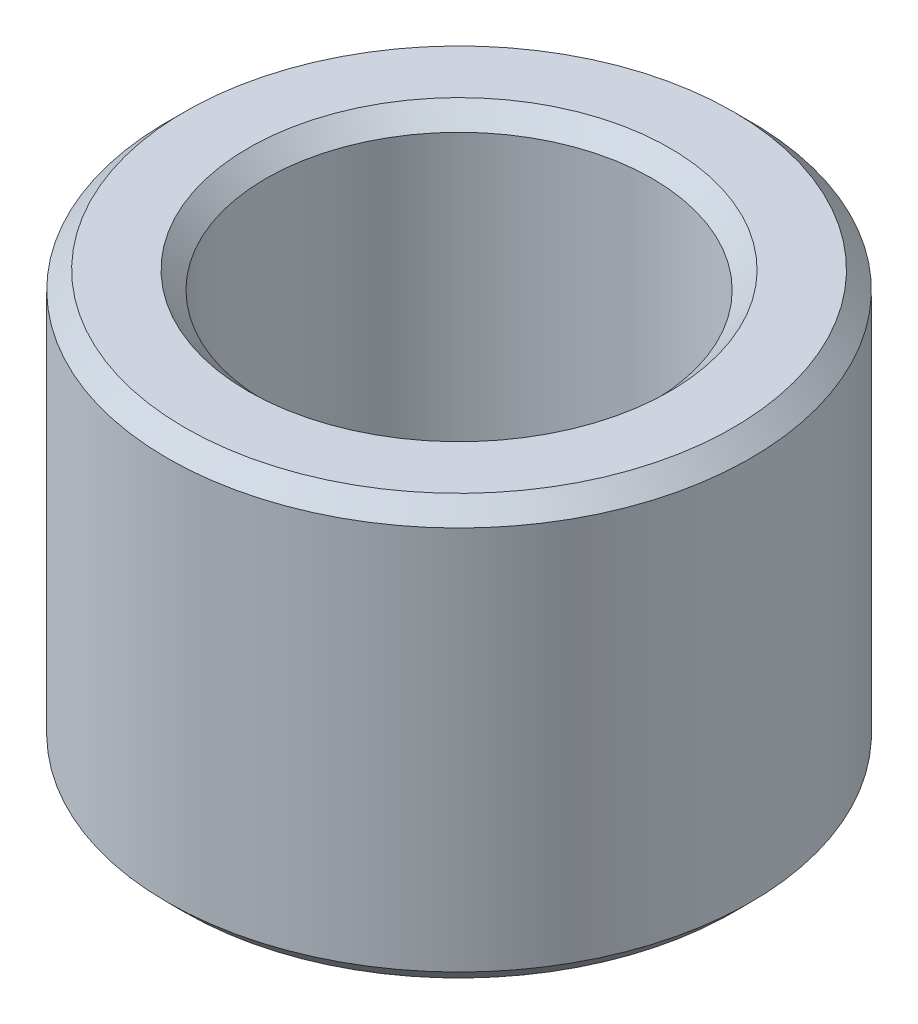
ISO-10303-21;
HEADER;
FILE_DESCRIPTION(('STEP AP214'),'2;1');
FILE_NAME('part.step','',(''),(''),'','','');
FILE_SCHEMA(('AUTOMOTIVE_DESIGN { 1 0 10303 214 1 1 1 1 }'));
ENDSEC;
DATA;
#1=APPLICATION_CONTEXT('core data for automotive mechanical design processes');
#2=APPLICATION_PROTOCOL_DEFINITION('international standard','automotive_design',2000,#1);
#3=PRODUCT_CONTEXT('',#1,'mechanical');
#4=PRODUCT('Part','Part','',(#3));
#5=PRODUCT_RELATED_PRODUCT_CATEGORY('part','',(#4));
#6=PRODUCT_DEFINITION_FORMATION('','',#4);
#7=PRODUCT_DEFINITION_CONTEXT('part definition',#1,'design');
#8=PRODUCT_DEFINITION('design','',#6,#7);
#9=PRODUCT_DEFINITION_SHAPE('','',#8);
#10=(LENGTH_UNIT() NAMED_UNIT(*) SI_UNIT(.MILLI.,.METRE.));
#11=(NAMED_UNIT(*) PLANE_ANGLE_UNIT() SI_UNIT($,.RADIAN.));
#12=(NAMED_UNIT(*) SI_UNIT($,.STERADIAN.) SOLID_ANGLE_UNIT());
#13=UNCERTAINTY_MEASURE_WITH_UNIT(LENGTH_MEASURE(1.E-05),#10,'distance_accuracy_value','');
#14=(GEOMETRIC_REPRESENTATION_CONTEXT(3) GLOBAL_UNCERTAINTY_ASSIGNED_CONTEXT((#13)) GLOBAL_UNIT_ASSIGNED_CONTEXT((#10,
#11,#12)) REPRESENTATION_CONTEXT('',''));
#15=CARTESIAN_POINT('',(0.,0.,0.));
#16=DIRECTION('',(0.,0.,1.));
#17=DIRECTION('',(1.,0.,0.));
#18=AXIS2_PLACEMENT_3D('',#15,#16,#17);
#19=CARTESIAN_POINT('',(0.,21.5944519399995,0.));
#20=DIRECTION('',(0.,-1.,0.));
#21=DIRECTION('',(0.,0.,-1.));
#22=AXIS2_PLACEMENT_3D('',#19,#20,#21);
#23=CYLINDRICAL_SURFACE('',#22,15.);
#24=CARTESIAN_POINT('',(0.,0.905493660631061,0.));
#25=DIRECTION('',(0.,1.,0.));
#26=DIRECTION('',(0.,0.,1.));
#27=AXIS2_PLACEMENT_3D('',#24,#25,#26);
#28=CIRCLE('',#27,15.);
#29=CARTESIAN_POINT('',(0.,0.905493660631061,15.));
#30=VERTEX_POINT('',#29);
#31=EDGE_CURVE('E10',#30,#30,#28,.T.);
#32=ORIENTED_EDGE('',*,*,#31,.T.);
#33=EDGE_LOOP('',(#32));
#34=FACE_BOUND('',#33,.T.);
#35=CARTESIAN_POINT('',(0.,20.6889582793684,0.));
#36=DIRECTION('',(0.,1.,0.));
#37=DIRECTION('',(0.,0.,1.));
#38=AXIS2_PLACEMENT_3D('',#35,#36,#37);
#39=CIRCLE('',#38,15.);
#40=CARTESIAN_POINT('',(0.,20.6889582793684,15.));
#41=VERTEX_POINT('',#40);
#42=EDGE_CURVE('E50',#41,#41,#39,.F.);
#43=ORIENTED_EDGE('',*,*,#42,.T.);
#44=EDGE_LOOP('',(#43));
#45=FACE_BOUND('',#44,.T.);
#46=ADVANCED_FACE('F39',(#34,#45),#23,.T.);
#47=CARTESIAN_POINT('',(0.,21.5944519399995,0.));
#48=DIRECTION('',(0.,1.,0.));
#49=DIRECTION('',(0.,0.,1.));
#50=AXIS2_PLACEMENT_3D('',#47,#48,#49);
#51=PLANE('',#50);
#52=CARTESIAN_POINT('',(0.,21.5944519399995,0.));
#53=DIRECTION('',(0.,1.,0.));
#54=DIRECTION('',(0.,0.,1.));
#55=AXIS2_PLACEMENT_3D('',#52,#53,#54);
#56=CIRCLE('',#55,10.8422639895881);
#57=CARTESIAN_POINT('',(0.,21.5944519399995,10.8422639895881));
#58=VERTEX_POINT('',#57);
#59=EDGE_CURVE('E58',#58,#58,#56,.F.);
#60=ORIENTED_EDGE('',*,*,#59,.T.);
#61=EDGE_LOOP('',(#60));
#62=FACE_BOUND('',#61,.T.);
#63=CARTESIAN_POINT('',(0.,21.5944519399995,0.));
#64=DIRECTION('',(0.,1.,0.));
#65=DIRECTION('',(0.,0.,1.));
#66=AXIS2_PLACEMENT_3D('',#63,#64,#65);
#67=CIRCLE('',#66,14.0945063393689);
#68=CARTESIAN_POINT('',(0.,21.5944519399995,14.0945063393689));
#69=VERTEX_POINT('',#68);
#70=EDGE_CURVE('E61',#69,#69,#67,.T.);
#71=ORIENTED_EDGE('',*,*,#70,.T.);
#72=EDGE_LOOP('',(#71));
#73=FACE_BOUND('',#72,.T.);
#74=ADVANCED_FACE('F88',(#62,#73),#51,.T.);
#75=CARTESIAN_POINT('',(0.,0.,0.));
#76=DIRECTION('',(0.,1.,0.));
#77=DIRECTION('',(0.,0.,1.));
#78=AXIS2_PLACEMENT_3D('',#75,#76,#77);
#79=PLANE('',#78);
#80=CARTESIAN_POINT('',(0.,0.,0.));
#81=DIRECTION('',(0.,1.,0.));
#82=DIRECTION('',(0.,0.,1.));
#83=AXIS2_PLACEMENT_3D('',#80,#81,#82);
#84=CIRCLE('',#83,10.8422639895881);
#85=CARTESIAN_POINT('',(0.,0.,-10.8422639895881));
#86=VERTEX_POINT('',#85);
#87=EDGE_CURVE('E51',#86,#86,#84,.T.);
#88=ORIENTED_EDGE('',*,*,#87,.T.);
#89=EDGE_LOOP('',(#88));
#90=FACE_BOUND('',#89,.T.);
#91=CARTESIAN_POINT('',(0.,0.,0.));
#92=DIRECTION('',(0.,1.,0.));
#93=DIRECTION('',(0.,0.,1.));
#94=AXIS2_PLACEMENT_3D('',#91,#92,#93);
#95=CIRCLE('',#94,14.0945063393689);
#96=CARTESIAN_POINT('',(0.,0.,14.0945063393689));
#97=VERTEX_POINT('',#96);
#98=EDGE_CURVE('E54',#97,#97,#95,.F.);
#99=ORIENTED_EDGE('',*,*,#98,.T.);
#100=EDGE_LOOP('',(#99));
#101=FACE_BOUND('',#100,.T.);
#102=ADVANCED_FACE('F83',(#90,#101),#79,.F.);
#103=CARTESIAN_POINT('',(0.,21.5944519399995,0.));
#104=DIRECTION('',(0.,-1.,0.));
#105=DIRECTION('',(0.,0.,-1.));
#106=AXIS2_PLACEMENT_3D('',#103,#104,#105);
#107=CYLINDRICAL_SURFACE('',#106,9.93677032895705);
#108=CARTESIAN_POINT('',(0.,20.6889582793684,0.));
#109=DIRECTION('',(0.,1.,0.));
#110=DIRECTION('',(0.,0.,1.));
#111=AXIS2_PLACEMENT_3D('',#108,#109,#110);
#112=CIRCLE('',#111,9.93677032895705);
#113=CARTESIAN_POINT('',(0.,20.6889582793684,9.93677032895705));
#114=VERTEX_POINT('',#113);
#115=EDGE_CURVE('E67',#114,#114,#112,.T.);
#116=ORIENTED_EDGE('',*,*,#115,.T.);
#117=EDGE_LOOP('',(#116));
#118=FACE_BOUND('',#117,.T.);
#119=CARTESIAN_POINT('',(0.,0.905493660631085,0.));
#120=DIRECTION('',(0.,1.,0.));
#121=DIRECTION('',(0.,0.,1.));
#122=AXIS2_PLACEMENT_3D('',#119,#120,#121);
#123=CIRCLE('',#122,9.93677032895705);
#124=CARTESIAN_POINT('',(0.,0.905493660631085,-9.93677032895705));
#125=VERTEX_POINT('',#124);
#126=EDGE_CURVE('E69',#125,#125,#123,.F.);
#127=ORIENTED_EDGE('',*,*,#126,.T.);
#128=EDGE_LOOP('',(#127));
#129=FACE_BOUND('',#128,.T.);
#130=ADVANCED_FACE('F71',(#118,#129),#107,.F.);
#131=CARTESIAN_POINT('',(0.,20.6889582793684,0.));
#132=DIRECTION('',(0.,1.,0.));
#133=DIRECTION('',(0.,0.,1.));
#134=AXIS2_PLACEMENT_3D('',#131,#132,#133);
#135=CONICAL_SURFACE('',#134,9.93677032895705,0.785398163397452);
#136=ORIENTED_EDGE('',*,*,#59,.F.);
#137=EDGE_LOOP('',(#136));
#138=FACE_BOUND('',#137,.T.);
#139=ORIENTED_EDGE('',*,*,#115,.F.);
#140=EDGE_LOOP('',(#139));
#141=FACE_BOUND('',#140,.T.);
#142=ADVANCED_FACE('F77',(#138,#141),#135,.F.);
#143=CARTESIAN_POINT('',(0.,0.,0.));
#144=DIRECTION('',(0.,-1.,0.));
#145=DIRECTION('',(0.,0.,-1.));
#146=AXIS2_PLACEMENT_3D('',#143,#144,#145);
#147=CONICAL_SURFACE('',#146,10.8422639895881,0.785398163397441);
#148=CARTESIAN_POINT('',(0.,0.905493660631085,-9.93677032895705));
#149=CARTESIAN_POINT('',(0.,0.896061434999511,-9.94620255458863));
#150=CARTESIAN_POINT('',(0.,0.886629209367937,-9.9556347802202));
#151=CARTESIAN_POINT('',(0.,0.86776475810479,-9.97449923148335));
#152=CARTESIAN_POINT('',(0.,0.858332532473216,-9.98393145711492));
#153=CARTESIAN_POINT('',(0.,0.839468081210068,-10.0027959083781));
#154=CARTESIAN_POINT('',(0.,0.830035855578494,-10.0122281340096));
#155=CARTESIAN_POINT('',(0.,0.811171404315347,-10.0310925852728));
#156=CARTESIAN_POINT('',(0.,0.801739178683773,-10.0405248109044));
#157=CARTESIAN_POINT('',(0.,0.782874727420625,-10.0593892621675));
#158=CARTESIAN_POINT('',(0.,0.773442501789051,-10.0688214877991));
#159=CARTESIAN_POINT('',(0.,0.754578050525904,-10.0876859390622));
#160=CARTESIAN_POINT('',(0.,0.74514582489433,-10.0971181646938));
#161=CARTESIAN_POINT('',(0.,0.726281373631183,-10.115982615957));
#162=CARTESIAN_POINT('',(0.,0.716849147999609,-10.1254148415885));
#163=CARTESIAN_POINT('',(0.,0.697984696736461,-10.1442792928517));
#164=CARTESIAN_POINT('',(0.,0.688552471104887,-10.1537115184832));
#165=CARTESIAN_POINT('',(0.,0.66968801984174,-10.1725759697464));
#166=CARTESIAN_POINT('',(0.,0.660255794210166,-10.182008195378));
#167=CARTESIAN_POINT('',(0.,0.641391342947018,-10.2008726466411));
#168=CARTESIAN_POINT('',(0.,0.631959117315445,-10.2103048722727));
#169=CARTESIAN_POINT('',(0.,0.613094666052297,-10.2291693235358));
#170=CARTESIAN_POINT('',(0.,0.603662440420723,-10.2386015491674));
#171=CARTESIAN_POINT('',(0.,0.584797989157575,-10.2574660004306));
#172=CARTESIAN_POINT('',(0.,0.575365763526002,-10.2668982260621));
#173=CARTESIAN_POINT('',(0.,0.556501312262854,-10.2857626773253));
#174=CARTESIAN_POINT('',(0.,0.54706908663128,-10.2951949029568));
#175=CARTESIAN_POINT('',(0.,0.528204635368133,-10.31405935422));
#176=CARTESIAN_POINT('',(0.,0.518772409736559,-10.3234915798516));
#177=CARTESIAN_POINT('',(0.,0.499907958473411,-10.3423560311147));
#178=CARTESIAN_POINT('',(0.,0.490475732841838,-10.3517882567463));
#179=CARTESIAN_POINT('',(0.,0.47161128157869,-10.3706527080094));
#180=CARTESIAN_POINT('',(0.,0.462179055947116,-10.380084933641));
#181=CARTESIAN_POINT('',(0.,0.443314604683969,-10.3989493849042));
#182=CARTESIAN_POINT('',(0.,0.433882379052395,-10.4083816105357));
#183=CARTESIAN_POINT('',(0.,0.415017927789247,-10.4272460617989));
#184=CARTESIAN_POINT('',(0.,0.405585702157674,-10.4366782874305));
#185=CARTESIAN_POINT('',(0.,0.386721250894526,-10.4555427386936));
#186=CARTESIAN_POINT('',(0.,0.377289025262952,-10.4649749643252));
#187=CARTESIAN_POINT('',(0.,0.358424573999804,-10.4838394155883));
#188=CARTESIAN_POINT('',(0.,0.348992348368231,-10.4932716412199));
#189=CARTESIAN_POINT('',(0.,0.330127897105083,-10.512136092483));
#190=CARTESIAN_POINT('',(0.,0.320695671473509,-10.5215683181146));
#191=CARTESIAN_POINT('',(0.,0.301831220210362,-10.5404327693778));
#192=CARTESIAN_POINT('',(0.,0.292398994578788,-10.5498649950093));
#193=CARTESIAN_POINT('',(0.,0.27353454331564,-10.5687294462725));
#194=CARTESIAN_POINT('',(0.,0.264102317684066,-10.5781616719041));
#195=CARTESIAN_POINT('',(0.,0.245237866420919,-10.5970261231672));
#196=CARTESIAN_POINT('',(0.,0.235805640789345,-10.6064583487988));
#197=CARTESIAN_POINT('',(0.,0.216941189526197,-10.6253228000619));
#198=CARTESIAN_POINT('',(0.,0.207508963894624,-10.6347550256935));
#199=CARTESIAN_POINT('',(0.,0.188644512631476,-10.6536194769566));
#200=CARTESIAN_POINT('',(0.,0.179212286999902,-10.6630517025882));
#201=CARTESIAN_POINT('',(0.,0.160347835736755,-10.6819161538514));
#202=CARTESIAN_POINT('',(0.,0.150915610105181,-10.6913483794829));
#203=CARTESIAN_POINT('',(0.,0.132051158842033,-10.7102128307461));
#204=CARTESIAN_POINT('',(0.,0.122618933210459,-10.7196450563777));
#205=CARTESIAN_POINT('',(0.,0.103754481947312,-10.7385095076408));
#206=CARTESIAN_POINT('',(0.,0.094322256315738,-10.7479417332724));
#207=CARTESIAN_POINT('',(0.,0.0754578050525904,-10.7668061845355));
#208=CARTESIAN_POINT('',(0.,0.0660255794210168,-10.7762384101671));
#209=CARTESIAN_POINT('',(0.,0.0471611281578691,-10.7951028614303));
#210=CARTESIAN_POINT('',(0.,0.0377289025262952,-10.8045350870618));
#211=CARTESIAN_POINT('',(0.,0.0188644512631473,-10.823399538325));
#212=CARTESIAN_POINT('',(0.,0.00943222563157339,-10.8328317639565));
#213=CARTESIAN_POINT('',(0.,0.,-10.8422639895881));
#214=B_SPLINE_CURVE_WITH_KNOTS('',3,(#148,#149,#150,#151,#152,#153,#154,#155,#156,#157,#158,
#159,#160,#161,#162,#163,#164,#165,#166,#167,#168,#169,#170,#171,#172,#173,#174,#175,#176,#177,
#178,#179,#180,#181,#182,#183,#184,#185,#186,#187,#188,#189,#190,#191,#192,#193,#194,#195,#196,
#197,#198,#199,#200,#201,#202,#203,#204,#205,#206,#207,#208,#209,#210,#211,#212,#213),
.UNSPECIFIED.,.F.,.F.,(4,2,2,2,2,2,2,2,2,2,2,2,2,2,2,2,2,2,2,2,2,2,2,2,2,2,2,2,2,2,2,2,4),(0.,
0.0400175442346044,0.0800350884692088,0.120052632703812,0.160070176938416,0.200087721173021,
0.240105265407625,0.280122809642228,0.320140353876833,0.360157898111437,0.400175442346041,
0.440192986580645,0.480210530815249,0.520228075049853,0.560245619284456,0.600263163519061,
0.640280707753665,0.68029825198827,0.720315796222874,0.760333340457477,0.800350884692082,
0.840368428926686,0.88038597316129,0.920403517395893,0.960421061630498,1.0004386058651,
1.04045615009971,1.08047369433431,1.12049123856891,1.16050878280352,1.20052632703812,
1.24054387127273,1.28056141550733),.UNSPECIFIED.);
#215=EDGE_CURVE('BSEAM73',#125,#86,#214,.T.);
#216=ORIENTED_EDGE('',*,*,#126,.F.);
#217=ORIENTED_EDGE('',*,*,#87,.F.);
#218=ORIENTED_EDGE('',*,*,#215,.T.);
#219=ORIENTED_EDGE('',*,*,#215,.F.);
#220=EDGE_LOOP('',(#216,#218,#217,#219));
#221=FACE_BOUND('',#220,.T.);
#222=ADVANCED_FACE('F73',(#221),#147,.F.);
#223=CARTESIAN_POINT('',(0.,0.905493660631061,0.));
#224=DIRECTION('',(0.,1.,0.));
#225=DIRECTION('',(0.,0.,1.));
#226=AXIS2_PLACEMENT_3D('',#223,#224,#225);
#227=CONICAL_SURFACE('',#226,15.,0.785398163397454);
#228=ORIENTED_EDGE('',*,*,#98,.F.);
#229=EDGE_LOOP('',(#228));
#230=FACE_BOUND('',#229,.T.);
#231=ORIENTED_EDGE('',*,*,#31,.F.);
#232=EDGE_LOOP('',(#231));
#233=FACE_BOUND('',#232,.T.);
#234=ADVANCED_FACE('F76',(#230,#233),#227,.T.);
#235=CARTESIAN_POINT('',(0.,21.5944519399995,0.));
#236=DIRECTION('',(0.,-1.,0.));
#237=DIRECTION('',(0.,0.,-1.));
#238=AXIS2_PLACEMENT_3D('',#235,#236,#237);
#239=CONICAL_SURFACE('',#238,14.0945063393689,0.785398163397445);
#240=ORIENTED_EDGE('',*,*,#42,.F.);
#241=EDGE_LOOP('',(#240));
#242=FACE_BOUND('',#241,.T.);
#243=ORIENTED_EDGE('',*,*,#70,.F.);
#244=EDGE_LOOP('',(#243));
#245=FACE_BOUND('',#244,.T.);
#246=ADVANCED_FACE('F45',(#242,#245),#239,.T.);
#247=CLOSED_SHELL('',(#46,#74,#102,#130,#142,#222,#234,#246));
#248=MANIFOLD_SOLID_BREP('B2',#247);
#249=ADVANCED_BREP_SHAPE_REPRESENTATION('',(#18,#248),#14);
#250=SHAPE_DEFINITION_REPRESENTATION(#9,#249);
ENDSEC;
END-ISO-10303-21;
